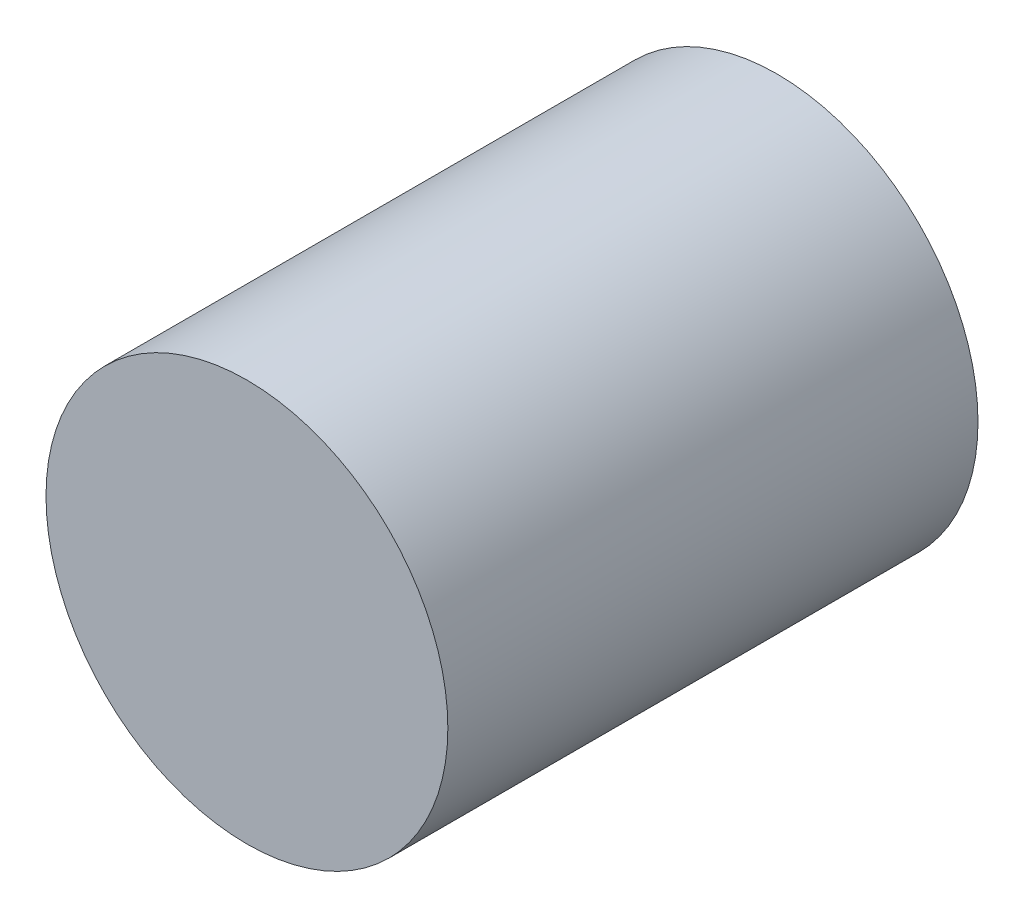
ISO-10303-21;
HEADER;
FILE_DESCRIPTION(('STEP AP214'),'2;1');
FILE_NAME('part.step','',(''),(''),'','','');
FILE_SCHEMA(('AUTOMOTIVE_DESIGN { 1 0 10303 214 1 1 1 1 }'));
ENDSEC;
DATA;
#1=APPLICATION_CONTEXT('core data for automotive mechanical design processes');
#2=APPLICATION_PROTOCOL_DEFINITION('international standard','automotive_design',2000,#1);
#3=PRODUCT_CONTEXT('',#1,'mechanical');
#4=PRODUCT('Part','Part','',(#3));
#5=PRODUCT_RELATED_PRODUCT_CATEGORY('part','',(#4));
#6=PRODUCT_DEFINITION_FORMATION('','',#4);
#7=PRODUCT_DEFINITION_CONTEXT('part definition',#1,'design');
#8=PRODUCT_DEFINITION('design','',#6,#7);
#9=PRODUCT_DEFINITION_SHAPE('','',#8);
#10=(LENGTH_UNIT() NAMED_UNIT(*) SI_UNIT(.MILLI.,.METRE.));
#11=(NAMED_UNIT(*) PLANE_ANGLE_UNIT() SI_UNIT($,.RADIAN.));
#12=(NAMED_UNIT(*) SI_UNIT($,.STERADIAN.) SOLID_ANGLE_UNIT());
#13=UNCERTAINTY_MEASURE_WITH_UNIT(LENGTH_MEASURE(1.E-05),#10,'distance_accuracy_value','');
#14=(GEOMETRIC_REPRESENTATION_CONTEXT(3) GLOBAL_UNCERTAINTY_ASSIGNED_CONTEXT((#13)) GLOBAL_UNIT_ASSIGNED_CONTEXT((#10,
#11,#12)) REPRESENTATION_CONTEXT('',''));
#15=CARTESIAN_POINT('',(0.,0.,0.));
#16=DIRECTION('',(0.,0.,1.));
#17=DIRECTION('',(1.,0.,0.));
#18=AXIS2_PLACEMENT_3D('',#15,#16,#17);
#19=CARTESIAN_POINT('',(99.1498732224159,-15.0872598131286,-40.));
#20=DIRECTION('',(0.,0.,1.));
#21=DIRECTION('',(1.,0.,0.));
#22=AXIS2_PLACEMENT_3D('',#19,#20,#21);
#23=CYLINDRICAL_SURFACE('',#22,15.1605023637927);
#24=CARTESIAN_POINT('',(99.1498732224159,-15.0872598131286,-40.));
#25=DIRECTION('',(0.,0.,1.));
#26=DIRECTION('',(1.,0.,0.));
#27=AXIS2_PLACEMENT_3D('',#24,#25,#26);
#28=CIRCLE('',#27,15.1605023637927);
#29=CARTESIAN_POINT('',(114.310375586209,-15.0872598131286,-40.));
#30=VERTEX_POINT('',#29);
#31=EDGE_CURVE('E10',#30,#30,#28,.T.);
#32=ORIENTED_EDGE('',*,*,#31,.T.);
#33=EDGE_LOOP('',(#32));
#34=FACE_BOUND('',#33,.T.);
#35=CARTESIAN_POINT('',(99.1498732224159,-15.0872598131286,0.));
#36=DIRECTION('',(0.,0.,1.));
#37=DIRECTION('',(1.,0.,0.));
#38=AXIS2_PLACEMENT_3D('',#35,#36,#37);
#39=CIRCLE('',#38,15.1605023637927);
#40=CARTESIAN_POINT('',(114.310375586209,-15.0872598131286,0.));
#41=VERTEX_POINT('',#40);
#42=EDGE_CURVE('E39',#41,#41,#39,.T.);
#43=ORIENTED_EDGE('',*,*,#42,.F.);
#44=EDGE_LOOP('',(#43));
#45=FACE_BOUND('',#44,.T.);
#46=ADVANCED_FACE('F36',(#34,#45),#23,.T.);
#47=CARTESIAN_POINT('',(0.,0.,-40.));
#48=DIRECTION('',(0.,0.,1.));
#49=DIRECTION('',(1.,0.,0.));
#50=AXIS2_PLACEMENT_3D('',#47,#48,#49);
#51=PLANE('',#50);
#52=ORIENTED_EDGE('',*,*,#31,.F.);
#53=EDGE_LOOP('',(#52));
#54=FACE_BOUND('',#53,.T.);
#55=ADVANCED_FACE('F51',(#54),#51,.F.);
#56=CARTESIAN_POINT('',(0.,0.,0.));
#57=DIRECTION('',(0.,0.,1.));
#58=DIRECTION('',(1.,0.,0.));
#59=AXIS2_PLACEMENT_3D('',#56,#57,#58);
#60=PLANE('',#59);
#61=ORIENTED_EDGE('',*,*,#42,.T.);
#62=EDGE_LOOP('',(#61));
#63=FACE_BOUND('',#62,.T.);
#64=ADVANCED_FACE('F48',(#63),#60,.T.);
#65=CLOSED_SHELL('',(#46,#55,#64));
#66=MANIFOLD_SOLID_BREP('B2',#65);
#67=ADVANCED_BREP_SHAPE_REPRESENTATION('',(#18,#66),#14);
#68=SHAPE_DEFINITION_REPRESENTATION(#9,#67);
ENDSEC;
END-ISO-10303-21;
